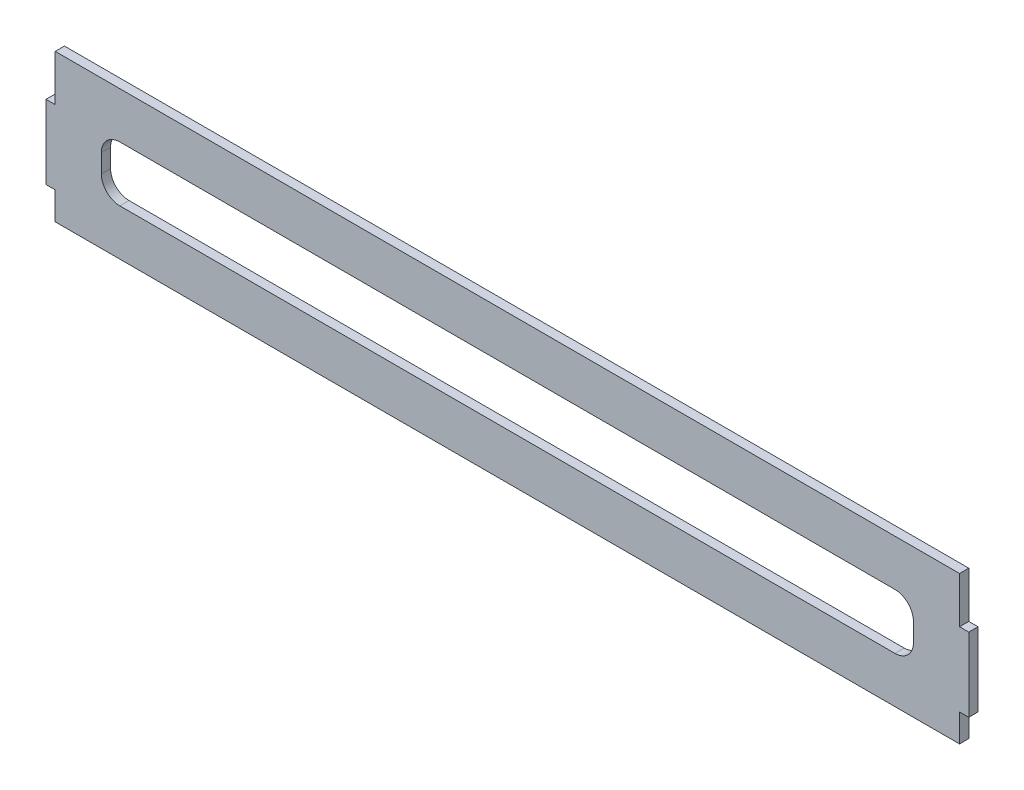
ISO-10303-21;
HEADER;
FILE_DESCRIPTION(('STEP AP214'),'2;1');
FILE_NAME('part.step','',(''),(''),'','','');
FILE_SCHEMA(('AUTOMOTIVE_DESIGN { 1 0 10303 214 1 1 1 1 }'));
ENDSEC;
DATA;
#1=APPLICATION_CONTEXT('core data for automotive mechanical design processes');
#2=APPLICATION_PROTOCOL_DEFINITION('international standard','automotive_design',2000,#1);
#3=PRODUCT_CONTEXT('',#1,'mechanical');
#4=PRODUCT('Part','Part','',(#3));
#5=PRODUCT_RELATED_PRODUCT_CATEGORY('part','',(#4));
#6=PRODUCT_DEFINITION_FORMATION('','',#4);
#7=PRODUCT_DEFINITION_CONTEXT('part definition',#1,'design');
#8=PRODUCT_DEFINITION('design','',#6,#7);
#9=PRODUCT_DEFINITION_SHAPE('','',#8);
#10=(LENGTH_UNIT() NAMED_UNIT(*) SI_UNIT(.MILLI.,.METRE.));
#11=(NAMED_UNIT(*) PLANE_ANGLE_UNIT() SI_UNIT($,.RADIAN.));
#12=(NAMED_UNIT(*) SI_UNIT($,.STERADIAN.) SOLID_ANGLE_UNIT());
#13=UNCERTAINTY_MEASURE_WITH_UNIT(LENGTH_MEASURE(1.E-05),#10,'distance_accuracy_value','');
#14=(GEOMETRIC_REPRESENTATION_CONTEXT(3) GLOBAL_UNCERTAINTY_ASSIGNED_CONTEXT((#13)) GLOBAL_UNIT_ASSIGNED_CONTEXT((#10,
#11,#12)) REPRESENTATION_CONTEXT('',''));
#15=CARTESIAN_POINT('',(0.,0.,0.));
#16=DIRECTION('',(0.,0.,1.));
#17=DIRECTION('',(1.,0.,0.));
#18=AXIS2_PLACEMENT_3D('',#15,#16,#17);
#19=CARTESIAN_POINT('',(490.,0.,5.));
#20=DIRECTION('',(0.,1.,0.));
#21=DIRECTION('',(-1.,0.,0.));
#22=AXIS2_PLACEMENT_3D('',#19,#20,#21);
#23=PLANE('',#22);
#24=DIRECTION('',(1.,0.,0.));
#25=VECTOR('',#24,1.);
#26=CARTESIAN_POINT('',(490.,0.,0.));
#27=LINE('',#26,#25);
#28=CARTESIAN_POINT('',(0.,0.,0.));
#29=VERTEX_POINT('',#28);
#30=CARTESIAN_POINT('',(490.,0.,0.));
#31=VERTEX_POINT('',#30);
#32=EDGE_CURVE('E176',#29,#31,#27,.T.);
#33=ORIENTED_EDGE('',*,*,#32,.T.);
#34=DIRECTION('',(0.,0.,-1.));
#35=VECTOR('',#34,1.);
#36=CARTESIAN_POINT('',(490.,0.,5.));
#37=LINE('',#36,#35);
#38=CARTESIAN_POINT('',(490.,0.,5.));
#39=VERTEX_POINT('',#38);
#40=EDGE_CURVE('E11',#39,#31,#37,.T.);
#41=ORIENTED_EDGE('',*,*,#40,.F.);
#42=DIRECTION('',(1.,0.,0.));
#43=VECTOR('',#42,1.);
#44=CARTESIAN_POINT('',(490.,0.,5.));
#45=LINE('',#44,#43);
#46=CARTESIAN_POINT('',(0.,0.,5.));
#47=VERTEX_POINT('',#46);
#48=EDGE_CURVE('E226',#47,#39,#45,.T.);
#49=ORIENTED_EDGE('',*,*,#48,.F.);
#50=DIRECTION('',(0.,0.,-1.));
#51=VECTOR('',#50,1.);
#52=CARTESIAN_POINT('',(0.,0.,5.));
#53=LINE('',#52,#51);
#54=EDGE_CURVE('E252',#47,#29,#53,.T.);
#55=ORIENTED_EDGE('',*,*,#54,.T.);
#56=EDGE_LOOP('',(#33,#41,#49,#55));
#57=FACE_BOUND('',#56,.T.);
#58=ADVANCED_FACE('F34',(#57),#23,.F.);
#59=CARTESIAN_POINT('',(490.,15.0000000000001,5.));
#60=DIRECTION('',(-1.,0.,0.));
#61=DIRECTION('',(0.,0.,1.));
#62=AXIS2_PLACEMENT_3D('',#59,#60,#61);
#63=PLANE('',#62);
#64=DIRECTION('',(0.,1.,0.));
#65=VECTOR('',#64,1.);
#66=CARTESIAN_POINT('',(490.,15.0000000000001,0.));
#67=LINE('',#66,#65);
#68=CARTESIAN_POINT('',(490.,15.0000000000001,0.));
#69=VERTEX_POINT('',#68);
#70=EDGE_CURVE('E255',#31,#69,#67,.T.);
#71=ORIENTED_EDGE('',*,*,#70,.T.);
#72=DIRECTION('',(0.,0.,-1.));
#73=VECTOR('',#72,1.);
#74=CARTESIAN_POINT('',(490.,15.0000000000001,5.));
#75=LINE('',#74,#73);
#76=CARTESIAN_POINT('',(490.,15.0000000000001,5.));
#77=VERTEX_POINT('',#76);
#78=EDGE_CURVE('E41',#77,#69,#75,.T.);
#79=ORIENTED_EDGE('',*,*,#78,.F.);
#80=DIRECTION('',(0.,1.,0.));
#81=VECTOR('',#80,1.);
#82=CARTESIAN_POINT('',(490.,15.0000000000001,5.));
#83=LINE('',#82,#81);
#84=EDGE_CURVE('E229',#39,#77,#83,.T.);
#85=ORIENTED_EDGE('',*,*,#84,.F.);
#86=ORIENTED_EDGE('',*,*,#40,.T.);
#87=EDGE_LOOP('',(#71,#79,#85,#86));
#88=FACE_BOUND('',#87,.T.);
#89=ADVANCED_FACE('F330',(#88),#63,.F.);
#90=CARTESIAN_POINT('',(495.,15.0000000000001,5.));
#91=DIRECTION('',(0.,1.,0.));
#92=DIRECTION('',(0.,0.,1.));
#93=AXIS2_PLACEMENT_3D('',#90,#91,#92);
#94=PLANE('',#93);
#95=DIRECTION('',(1.,0.,0.));
#96=VECTOR('',#95,1.);
#97=CARTESIAN_POINT('',(495.,15.0000000000001,0.));
#98=LINE('',#97,#96);
#99=CARTESIAN_POINT('',(495.,15.0000000000001,0.));
#100=VERTEX_POINT('',#99);
#101=EDGE_CURVE('E257',#69,#100,#98,.T.);
#102=ORIENTED_EDGE('',*,*,#101,.T.);
#103=DIRECTION('',(0.,0.,-1.));
#104=VECTOR('',#103,1.);
#105=CARTESIAN_POINT('',(495.,15.0000000000001,5.));
#106=LINE('',#105,#104);
#107=CARTESIAN_POINT('',(495.,15.0000000000001,5.));
#108=VERTEX_POINT('',#107);
#109=EDGE_CURVE('E302',#108,#100,#106,.T.);
#110=ORIENTED_EDGE('',*,*,#109,.F.);
#111=DIRECTION('',(1.,0.,0.));
#112=VECTOR('',#111,1.);
#113=CARTESIAN_POINT('',(495.,15.0000000000001,5.));
#114=LINE('',#113,#112);
#115=EDGE_CURVE('E232',#77,#108,#114,.T.);
#116=ORIENTED_EDGE('',*,*,#115,.F.);
#117=ORIENTED_EDGE('',*,*,#78,.T.);
#118=EDGE_LOOP('',(#102,#110,#116,#117));
#119=FACE_BOUND('',#118,.T.);
#120=ADVANCED_FACE('F309',(#119),#94,.F.);
#121=CARTESIAN_POINT('',(495.,55.0000000000001,5.));
#122=DIRECTION('',(-1.,0.,0.));
#123=DIRECTION('',(0.,0.,1.));
#124=AXIS2_PLACEMENT_3D('',#121,#122,#123);
#125=PLANE('',#124);
#126=DIRECTION('',(0.,1.,0.));
#127=VECTOR('',#126,1.);
#128=CARTESIAN_POINT('',(495.,55.0000000000001,0.));
#129=LINE('',#128,#127);
#130=CARTESIAN_POINT('',(495.,55.0000000000001,0.));
#131=VERTEX_POINT('',#130);
#132=EDGE_CURVE('E259',#100,#131,#129,.T.);
#133=ORIENTED_EDGE('',*,*,#132,.T.);
#134=DIRECTION('',(0.,0.,-1.));
#135=VECTOR('',#134,1.);
#136=CARTESIAN_POINT('',(495.,55.0000000000001,5.));
#137=LINE('',#136,#135);
#138=CARTESIAN_POINT('',(495.,55.0000000000001,5.));
#139=VERTEX_POINT('',#138);
#140=EDGE_CURVE('E299',#139,#131,#137,.T.);
#141=ORIENTED_EDGE('',*,*,#140,.F.);
#142=DIRECTION('',(0.,1.,0.));
#143=VECTOR('',#142,1.);
#144=CARTESIAN_POINT('',(495.,55.0000000000001,5.));
#145=LINE('',#144,#143);
#146=EDGE_CURVE('E234',#108,#139,#145,.T.);
#147=ORIENTED_EDGE('',*,*,#146,.F.);
#148=ORIENTED_EDGE('',*,*,#109,.T.);
#149=EDGE_LOOP('',(#133,#141,#147,#148));
#150=FACE_BOUND('',#149,.T.);
#151=ADVANCED_FACE('F318',(#150),#125,.F.);
#152=CARTESIAN_POINT('',(490.,55.0000000000001,5.));
#153=DIRECTION('',(0.,-1.,0.));
#154=DIRECTION('',(0.,0.,-1.));
#155=AXIS2_PLACEMENT_3D('',#152,#153,#154);
#156=PLANE('',#155);
#157=DIRECTION('',(-1.,0.,0.));
#158=VECTOR('',#157,1.);
#159=CARTESIAN_POINT('',(490.,55.0000000000001,0.));
#160=LINE('',#159,#158);
#161=CARTESIAN_POINT('',(490.,55.0000000000001,0.));
#162=VERTEX_POINT('',#161);
#163=EDGE_CURVE('E261',#131,#162,#160,.T.);
#164=ORIENTED_EDGE('',*,*,#163,.T.);
#165=DIRECTION('',(0.,0.,-1.));
#166=VECTOR('',#165,1.);
#167=CARTESIAN_POINT('',(490.,55.0000000000001,5.));
#168=LINE('',#167,#166);
#169=CARTESIAN_POINT('',(490.,55.0000000000001,5.));
#170=VERTEX_POINT('',#169);
#171=EDGE_CURVE('E296',#170,#162,#168,.T.);
#172=ORIENTED_EDGE('',*,*,#171,.F.);
#173=DIRECTION('',(-1.,0.,0.));
#174=VECTOR('',#173,1.);
#175=CARTESIAN_POINT('',(490.,55.0000000000001,5.));
#176=LINE('',#175,#174);
#177=EDGE_CURVE('E236',#139,#170,#176,.T.);
#178=ORIENTED_EDGE('',*,*,#177,.F.);
#179=ORIENTED_EDGE('',*,*,#140,.T.);
#180=EDGE_LOOP('',(#164,#172,#178,#179));
#181=FACE_BOUND('',#180,.T.);
#182=ADVANCED_FACE('F322',(#181),#156,.F.);
#183=CARTESIAN_POINT('',(490.,79.9999999999999,5.));
#184=DIRECTION('',(-1.,0.,0.));
#185=DIRECTION('',(0.,0.,1.));
#186=AXIS2_PLACEMENT_3D('',#183,#184,#185);
#187=PLANE('',#186);
#188=DIRECTION('',(0.,1.,0.));
#189=VECTOR('',#188,1.);
#190=CARTESIAN_POINT('',(490.,79.9999999999999,0.));
#191=LINE('',#190,#189);
#192=CARTESIAN_POINT('',(490.,79.9999999999999,0.));
#193=VERTEX_POINT('',#192);
#194=EDGE_CURVE('E263',#162,#193,#191,.T.);
#195=ORIENTED_EDGE('',*,*,#194,.T.);
#196=DIRECTION('',(0.,0.,-1.));
#197=VECTOR('',#196,1.);
#198=CARTESIAN_POINT('',(490.,79.9999999999999,5.));
#199=LINE('',#198,#197);
#200=CARTESIAN_POINT('',(490.,79.9999999999999,5.));
#201=VERTEX_POINT('',#200);
#202=EDGE_CURVE('E293',#201,#193,#199,.T.);
#203=ORIENTED_EDGE('',*,*,#202,.F.);
#204=DIRECTION('',(0.,1.,0.));
#205=VECTOR('',#204,1.);
#206=CARTESIAN_POINT('',(490.,79.9999999999999,5.));
#207=LINE('',#206,#205);
#208=EDGE_CURVE('E238',#170,#201,#207,.T.);
#209=ORIENTED_EDGE('',*,*,#208,.F.);
#210=ORIENTED_EDGE('',*,*,#171,.T.);
#211=EDGE_LOOP('',(#195,#203,#209,#210));
#212=FACE_BOUND('',#211,.T.);
#213=ADVANCED_FACE('F363',(#212),#187,.F.);
#214=CARTESIAN_POINT('',(0.,79.9999999999999,5.));
#215=DIRECTION('',(0.,-1.,0.));
#216=DIRECTION('',(0.,0.,-1.));
#217=AXIS2_PLACEMENT_3D('',#214,#215,#216);
#218=PLANE('',#217);
#219=DIRECTION('',(-1.,0.,0.));
#220=VECTOR('',#219,1.);
#221=CARTESIAN_POINT('',(0.,79.9999999999999,0.));
#222=LINE('',#221,#220);
#223=CARTESIAN_POINT('',(0.,79.9999999999999,0.));
#224=VERTEX_POINT('',#223);
#225=EDGE_CURVE('E265',#193,#224,#222,.T.);
#226=ORIENTED_EDGE('',*,*,#225,.T.);
#227=DIRECTION('',(0.,0.,-1.));
#228=VECTOR('',#227,1.);
#229=CARTESIAN_POINT('',(0.,79.9999999999999,5.));
#230=LINE('',#229,#228);
#231=CARTESIAN_POINT('',(0.,79.9999999999999,5.));
#232=VERTEX_POINT('',#231);
#233=EDGE_CURVE('E290',#232,#224,#230,.T.);
#234=ORIENTED_EDGE('',*,*,#233,.F.);
#235=DIRECTION('',(-1.,0.,0.));
#236=VECTOR('',#235,1.);
#237=CARTESIAN_POINT('',(0.,79.9999999999999,5.));
#238=LINE('',#237,#236);
#239=EDGE_CURVE('E240',#201,#232,#238,.T.);
#240=ORIENTED_EDGE('',*,*,#239,.F.);
#241=ORIENTED_EDGE('',*,*,#202,.T.);
#242=EDGE_LOOP('',(#226,#234,#240,#241));
#243=FACE_BOUND('',#242,.T.);
#244=ADVANCED_FACE('F361',(#243),#218,.F.);
#245=CARTESIAN_POINT('',(0.,55.0000000000001,5.));
#246=DIRECTION('',(1.,0.,0.));
#247=DIRECTION('',(0.,0.,-1.));
#248=AXIS2_PLACEMENT_3D('',#245,#246,#247);
#249=PLANE('',#248);
#250=DIRECTION('',(0.,-1.,0.));
#251=VECTOR('',#250,1.);
#252=CARTESIAN_POINT('',(0.,55.0000000000001,0.));
#253=LINE('',#252,#251);
#254=CARTESIAN_POINT('',(0.,55.0000000000001,0.));
#255=VERTEX_POINT('',#254);
#256=EDGE_CURVE('E267',#224,#255,#253,.T.);
#257=ORIENTED_EDGE('',*,*,#256,.T.);
#258=DIRECTION('',(0.,0.,-1.));
#259=VECTOR('',#258,1.);
#260=CARTESIAN_POINT('',(0.,55.0000000000001,5.));
#261=LINE('',#260,#259);
#262=CARTESIAN_POINT('',(0.,55.0000000000001,5.));
#263=VERTEX_POINT('',#262);
#264=EDGE_CURVE('E287',#263,#255,#261,.T.);
#265=ORIENTED_EDGE('',*,*,#264,.F.);
#266=DIRECTION('',(0.,-1.,0.));
#267=VECTOR('',#266,1.);
#268=CARTESIAN_POINT('',(0.,55.0000000000001,5.));
#269=LINE('',#268,#267);
#270=EDGE_CURVE('E242',#232,#263,#269,.T.);
#271=ORIENTED_EDGE('',*,*,#270,.F.);
#272=ORIENTED_EDGE('',*,*,#233,.T.);
#273=EDGE_LOOP('',(#257,#265,#271,#272));
#274=FACE_BOUND('',#273,.T.);
#275=ADVANCED_FACE('F357',(#274),#249,.F.);
#276=CARTESIAN_POINT('',(-5.,55.0000000000001,5.));
#277=DIRECTION('',(0.,-1.,0.));
#278=DIRECTION('',(0.,0.,-1.));
#279=AXIS2_PLACEMENT_3D('',#276,#277,#278);
#280=PLANE('',#279);
#281=DIRECTION('',(-1.,0.,0.));
#282=VECTOR('',#281,1.);
#283=CARTESIAN_POINT('',(-5.,55.0000000000001,0.));
#284=LINE('',#283,#282);
#285=CARTESIAN_POINT('',(-5.,55.0000000000001,0.));
#286=VERTEX_POINT('',#285);
#287=EDGE_CURVE('E269',#255,#286,#284,.T.);
#288=ORIENTED_EDGE('',*,*,#287,.T.);
#289=DIRECTION('',(0.,0.,-1.));
#290=VECTOR('',#289,1.);
#291=CARTESIAN_POINT('',(-5.,55.0000000000001,5.));
#292=LINE('',#291,#290);
#293=CARTESIAN_POINT('',(-5.,55.0000000000001,5.));
#294=VERTEX_POINT('',#293);
#295=EDGE_CURVE('E284',#294,#286,#292,.T.);
#296=ORIENTED_EDGE('',*,*,#295,.F.);
#297=DIRECTION('',(-1.,0.,0.));
#298=VECTOR('',#297,1.);
#299=CARTESIAN_POINT('',(-5.,55.0000000000001,5.));
#300=LINE('',#299,#298);
#301=EDGE_CURVE('E244',#263,#294,#300,.T.);
#302=ORIENTED_EDGE('',*,*,#301,.F.);
#303=ORIENTED_EDGE('',*,*,#264,.T.);
#304=EDGE_LOOP('',(#288,#296,#302,#303));
#305=FACE_BOUND('',#304,.T.);
#306=ADVANCED_FACE('F352',(#305),#280,.F.);
#307=CARTESIAN_POINT('',(-5.,15.,5.));
#308=DIRECTION('',(1.,0.,0.));
#309=DIRECTION('',(0.,0.,-1.));
#310=AXIS2_PLACEMENT_3D('',#307,#308,#309);
#311=PLANE('',#310);
#312=DIRECTION('',(0.,-1.,0.));
#313=VECTOR('',#312,1.);
#314=CARTESIAN_POINT('',(-5.,15.,0.));
#315=LINE('',#314,#313);
#316=CARTESIAN_POINT('',(-5.,15.,0.));
#317=VERTEX_POINT('',#316);
#318=EDGE_CURVE('E271',#286,#317,#315,.T.);
#319=ORIENTED_EDGE('',*,*,#318,.T.);
#320=DIRECTION('',(0.,0.,-1.));
#321=VECTOR('',#320,1.);
#322=CARTESIAN_POINT('',(-5.,15.,5.));
#323=LINE('',#322,#321);
#324=CARTESIAN_POINT('',(-5.,15.,5.));
#325=VERTEX_POINT('',#324);
#326=EDGE_CURVE('E281',#325,#317,#323,.T.);
#327=ORIENTED_EDGE('',*,*,#326,.F.);
#328=DIRECTION('',(0.,-1.,0.));
#329=VECTOR('',#328,1.);
#330=CARTESIAN_POINT('',(-5.,15.,5.));
#331=LINE('',#330,#329);
#332=EDGE_CURVE('E246',#294,#325,#331,.T.);
#333=ORIENTED_EDGE('',*,*,#332,.F.);
#334=ORIENTED_EDGE('',*,*,#295,.T.);
#335=EDGE_LOOP('',(#319,#327,#333,#334));
#336=FACE_BOUND('',#335,.T.);
#337=ADVANCED_FACE('F346',(#336),#311,.F.);
#338=CARTESIAN_POINT('',(0.,15.,5.));
#339=DIRECTION('',(0.,1.,0.));
#340=DIRECTION('',(0.,0.,1.));
#341=AXIS2_PLACEMENT_3D('',#338,#339,#340);
#342=PLANE('',#341);
#343=DIRECTION('',(1.,0.,0.));
#344=VECTOR('',#343,1.);
#345=CARTESIAN_POINT('',(0.,15.,0.));
#346=LINE('',#345,#344);
#347=CARTESIAN_POINT('',(0.,15.,0.));
#348=VERTEX_POINT('',#347);
#349=EDGE_CURVE('E273',#317,#348,#346,.T.);
#350=ORIENTED_EDGE('',*,*,#349,.T.);
#351=DIRECTION('',(0.,0.,-1.));
#352=VECTOR('',#351,1.);
#353=CARTESIAN_POINT('',(0.,15.,5.));
#354=LINE('',#353,#352);
#355=CARTESIAN_POINT('',(0.,15.,5.));
#356=VERTEX_POINT('',#355);
#357=EDGE_CURVE('E278',#356,#348,#354,.T.);
#358=ORIENTED_EDGE('',*,*,#357,.F.);
#359=DIRECTION('',(1.,0.,0.));
#360=VECTOR('',#359,1.);
#361=CARTESIAN_POINT('',(0.,15.,5.));
#362=LINE('',#361,#360);
#363=EDGE_CURVE('E248',#325,#356,#362,.T.);
#364=ORIENTED_EDGE('',*,*,#363,.F.);
#365=ORIENTED_EDGE('',*,*,#326,.T.);
#366=EDGE_LOOP('',(#350,#358,#364,#365));
#367=FACE_BOUND('',#366,.T.);
#368=ADVANCED_FACE('F342',(#367),#342,.F.);
#369=CARTESIAN_POINT('',(0.,0.,5.));
#370=DIRECTION('',(1.,0.,0.));
#371=DIRECTION('',(0.,0.,-1.));
#372=AXIS2_PLACEMENT_3D('',#369,#370,#371);
#373=PLANE('',#372);
#374=DIRECTION('',(0.,-1.,0.));
#375=VECTOR('',#374,1.);
#376=CARTESIAN_POINT('',(0.,0.,0.));
#377=LINE('',#376,#375);
#378=EDGE_CURVE('E230',#348,#29,#377,.T.);
#379=ORIENTED_EDGE('',*,*,#378,.T.);
#380=ORIENTED_EDGE('',*,*,#54,.F.);
#381=DIRECTION('',(0.,-1.,0.));
#382=VECTOR('',#381,1.);
#383=CARTESIAN_POINT('',(0.,0.,5.));
#384=LINE('',#383,#382);
#385=EDGE_CURVE('E250',#356,#47,#384,.T.);
#386=ORIENTED_EDGE('',*,*,#385,.F.);
#387=ORIENTED_EDGE('',*,*,#357,.T.);
#388=EDGE_LOOP('',(#379,#380,#386,#387));
#389=FACE_BOUND('',#388,.T.);
#390=ADVANCED_FACE('F337',(#389),#373,.F.);
#391=CARTESIAN_POINT('',(0.,0.,5.));
#392=DIRECTION('',(0.,0.,-1.));
#393=DIRECTION('',(-1.,0.,0.));
#394=AXIS2_PLACEMENT_3D('',#391,#392,#393);
#395=PLANE('',#394);
#396=DIRECTION('',(0.,1.,0.));
#397=VECTOR('',#396,1.);
#398=CARTESIAN_POINT('',(465.,35.,5.));
#399=LINE('',#398,#397);
#400=CARTESIAN_POINT('',(465.,35.,5.));
#401=VERTEX_POINT('',#400);
#402=CARTESIAN_POINT('',(465.,45.,5.));
#403=VERTEX_POINT('',#402);
#404=EDGE_CURVE('E190',#401,#403,#399,.T.);
#405=ORIENTED_EDGE('',*,*,#404,.F.);
#406=CARTESIAN_POINT('',(455.,35.,5.));
#407=DIRECTION('',(0.,0.,1.));
#408=DIRECTION('',(-1.,0.,0.));
#409=AXIS2_PLACEMENT_3D('',#406,#407,#408);
#410=CIRCLE('',#409,10.);
#411=CARTESIAN_POINT('',(455.,25.,5.));
#412=VERTEX_POINT('',#411);
#413=EDGE_CURVE('E48',#412,#401,#410,.T.);
#414=ORIENTED_EDGE('',*,*,#413,.F.);
#415=DIRECTION('',(1.,0.,0.));
#416=VECTOR('',#415,1.);
#417=CARTESIAN_POINT('',(35.,25.,5.));
#418=LINE('',#417,#416);
#419=CARTESIAN_POINT('',(35.,25.,5.));
#420=VERTEX_POINT('',#419);
#421=EDGE_CURVE('E182',#420,#412,#418,.T.);
#422=ORIENTED_EDGE('',*,*,#421,.F.);
#423=CARTESIAN_POINT('',(35.,35.,5.));
#424=DIRECTION('',(0.,0.,1.));
#425=DIRECTION('',(-1.,0.,0.));
#426=AXIS2_PLACEMENT_3D('',#423,#424,#425);
#427=CIRCLE('',#426,10.);
#428=CARTESIAN_POINT('',(25.,35.,5.));
#429=VERTEX_POINT('',#428);
#430=EDGE_CURVE('E209',#429,#420,#427,.T.);
#431=ORIENTED_EDGE('',*,*,#430,.F.);
#432=DIRECTION('',(0.,-1.,0.));
#433=VECTOR('',#432,1.);
#434=CARTESIAN_POINT('',(25.,35.,5.));
#435=LINE('',#434,#433);
#436=CARTESIAN_POINT('',(25.,45.,5.));
#437=VERTEX_POINT('',#436);
#438=EDGE_CURVE('E206',#437,#429,#435,.T.);
#439=ORIENTED_EDGE('',*,*,#438,.F.);
#440=CARTESIAN_POINT('',(35.,45.,5.));
#441=DIRECTION('',(0.,0.,1.));
#442=DIRECTION('',(1.,0.,0.));
#443=AXIS2_PLACEMENT_3D('',#440,#441,#442);
#444=CIRCLE('',#443,10.);
#445=CARTESIAN_POINT('',(35.,55.,5.));
#446=VERTEX_POINT('',#445);
#447=EDGE_CURVE('E203',#446,#437,#444,.T.);
#448=ORIENTED_EDGE('',*,*,#447,.F.);
#449=DIRECTION('',(-1.,0.,0.));
#450=VECTOR('',#449,1.);
#451=CARTESIAN_POINT('',(35.,55.,5.));
#452=LINE('',#451,#450);
#453=CARTESIAN_POINT('',(455.,55.,5.));
#454=VERTEX_POINT('',#453);
#455=EDGE_CURVE('E200',#454,#446,#452,.T.);
#456=ORIENTED_EDGE('',*,*,#455,.F.);
#457=CARTESIAN_POINT('',(455.,45.,5.));
#458=DIRECTION('',(0.,0.,1.));
#459=DIRECTION('',(1.,0.,0.));
#460=AXIS2_PLACEMENT_3D('',#457,#458,#459);
#461=CIRCLE('',#460,10.);
#462=EDGE_CURVE('E197',#403,#454,#461,.T.);
#463=ORIENTED_EDGE('',*,*,#462,.F.);
#464=EDGE_LOOP('',(#405,#414,#422,#431,#439,#448,#456,#463));
#465=FACE_BOUND('',#464,.T.);
#466=ORIENTED_EDGE('',*,*,#48,.T.);
#467=ORIENTED_EDGE('',*,*,#84,.T.);
#468=ORIENTED_EDGE('',*,*,#115,.T.);
#469=ORIENTED_EDGE('',*,*,#146,.T.);
#470=ORIENTED_EDGE('',*,*,#177,.T.);
#471=ORIENTED_EDGE('',*,*,#208,.T.);
#472=ORIENTED_EDGE('',*,*,#239,.T.);
#473=ORIENTED_EDGE('',*,*,#270,.T.);
#474=ORIENTED_EDGE('',*,*,#301,.T.);
#475=ORIENTED_EDGE('',*,*,#332,.T.);
#476=ORIENTED_EDGE('',*,*,#363,.T.);
#477=ORIENTED_EDGE('',*,*,#385,.T.);
#478=EDGE_LOOP('',(#466,#467,#468,#469,#470,#471,#472,#473,#474,#475,#476,#477));
#479=FACE_BOUND('',#478,.T.);
#480=ADVANCED_FACE('F326',(#465,#479),#395,.F.);
#481=CARTESIAN_POINT('',(0.,0.,0.));
#482=DIRECTION('',(0.,0.,-1.));
#483=DIRECTION('',(-1.,0.,0.));
#484=AXIS2_PLACEMENT_3D('',#481,#482,#483);
#485=PLANE('',#484);
#486=CARTESIAN_POINT('',(455.,35.,0.));
#487=DIRECTION('',(0.,0.,-1.));
#488=DIRECTION('',(-1.,0.,0.));
#489=AXIS2_PLACEMENT_3D('',#486,#487,#488);
#490=CIRCLE('',#489,10.);
#491=CARTESIAN_POINT('',(455.,25.,0.));
#492=VERTEX_POINT('',#491);
#493=CARTESIAN_POINT('',(465.,35.,0.));
#494=VERTEX_POINT('',#493);
#495=EDGE_CURVE('E180',#492,#494,#490,.F.);
#496=ORIENTED_EDGE('',*,*,#495,.T.);
#497=DIRECTION('',(0.,1.,0.));
#498=VECTOR('',#497,1.);
#499=CARTESIAN_POINT('',(465.,35.,0.));
#500=LINE('',#499,#498);
#501=CARTESIAN_POINT('',(465.,45.,0.));
#502=VERTEX_POINT('',#501);
#503=EDGE_CURVE('E169',#494,#502,#500,.T.);
#504=ORIENTED_EDGE('',*,*,#503,.T.);
#505=CARTESIAN_POINT('',(455.,45.,0.));
#506=DIRECTION('',(0.,0.,-1.));
#507=DIRECTION('',(-1.,0.,0.));
#508=AXIS2_PLACEMENT_3D('',#505,#506,#507);
#509=CIRCLE('',#508,10.);
#510=CARTESIAN_POINT('',(455.,55.,0.));
#511=VERTEX_POINT('',#510);
#512=EDGE_CURVE('E540',#502,#511,#509,.F.);
#513=ORIENTED_EDGE('',*,*,#512,.T.);
#514=DIRECTION('',(-1.,0.,0.));
#515=VECTOR('',#514,1.);
#516=CARTESIAN_POINT('',(35.,55.,0.));
#517=LINE('',#516,#515);
#518=CARTESIAN_POINT('',(35.,55.,0.));
#519=VERTEX_POINT('',#518);
#520=EDGE_CURVE('E545',#511,#519,#517,.T.);
#521=ORIENTED_EDGE('',*,*,#520,.T.);
#522=CARTESIAN_POINT('',(35.,45.,0.));
#523=DIRECTION('',(0.,0.,-1.));
#524=DIRECTION('',(-1.,0.,0.));
#525=AXIS2_PLACEMENT_3D('',#522,#523,#524);
#526=CIRCLE('',#525,10.);
#527=CARTESIAN_POINT('',(25.,45.,0.));
#528=VERTEX_POINT('',#527);
#529=EDGE_CURVE('E548',#519,#528,#526,.F.);
#530=ORIENTED_EDGE('',*,*,#529,.T.);
#531=DIRECTION('',(0.,-1.,0.));
#532=VECTOR('',#531,1.);
#533=CARTESIAN_POINT('',(25.,35.,0.));
#534=LINE('',#533,#532);
#535=CARTESIAN_POINT('',(25.,35.,0.));
#536=VERTEX_POINT('',#535);
#537=EDGE_CURVE('E552',#528,#536,#534,.T.);
#538=ORIENTED_EDGE('',*,*,#537,.T.);
#539=CARTESIAN_POINT('',(35.,35.,0.));
#540=DIRECTION('',(0.,0.,-1.));
#541=DIRECTION('',(-1.,0.,0.));
#542=AXIS2_PLACEMENT_3D('',#539,#540,#541);
#543=CIRCLE('',#542,10.);
#544=CARTESIAN_POINT('',(35.,25.,0.));
#545=VERTEX_POINT('',#544);
#546=EDGE_CURVE('E192',#536,#545,#543,.F.);
#547=ORIENTED_EDGE('',*,*,#546,.T.);
#548=DIRECTION('',(1.,0.,0.));
#549=VECTOR('',#548,1.);
#550=CARTESIAN_POINT('',(35.,25.,0.));
#551=LINE('',#550,#549);
#552=EDGE_CURVE('E188',#545,#492,#551,.T.);
#553=ORIENTED_EDGE('',*,*,#552,.T.);
#554=EDGE_LOOP('',(#496,#504,#513,#521,#530,#538,#547,#553));
#555=FACE_BOUND('',#554,.T.);
#556=ORIENTED_EDGE('',*,*,#32,.F.);
#557=ORIENTED_EDGE('',*,*,#378,.F.);
#558=ORIENTED_EDGE('',*,*,#349,.F.);
#559=ORIENTED_EDGE('',*,*,#318,.F.);
#560=ORIENTED_EDGE('',*,*,#287,.F.);
#561=ORIENTED_EDGE('',*,*,#256,.F.);
#562=ORIENTED_EDGE('',*,*,#225,.F.);
#563=ORIENTED_EDGE('',*,*,#194,.F.);
#564=ORIENTED_EDGE('',*,*,#163,.F.);
#565=ORIENTED_EDGE('',*,*,#132,.F.);
#566=ORIENTED_EDGE('',*,*,#101,.F.);
#567=ORIENTED_EDGE('',*,*,#70,.F.);
#568=EDGE_LOOP('',(#556,#557,#558,#559,#560,#561,#562,#563,#564,#565,#566,#567));
#569=FACE_BOUND('',#568,.T.);
#570=ADVANCED_FACE('F185',(#555,#569),#485,.T.);
#571=CARTESIAN_POINT('',(455.,35.,-0.00100000000000013));
#572=DIRECTION('',(0.,0.,1.));
#573=DIRECTION('',(1.,0.,0.));
#574=AXIS2_PLACEMENT_3D('',#571,#572,#573);
#575=CYLINDRICAL_SURFACE('',#574,10.);
#576=DIRECTION('',(0.,0.,1.));
#577=VECTOR('',#576,1.);
#578=CARTESIAN_POINT('',(455.,25.,-0.00100000000000013));
#579=LINE('',#578,#577);
#580=EDGE_CURVE('E177',#492,#412,#579,.T.);
#581=ORIENTED_EDGE('',*,*,#580,.T.);
#582=ORIENTED_EDGE('',*,*,#413,.T.);
#583=DIRECTION('',(0.,0.,1.));
#584=VECTOR('',#583,1.);
#585=CARTESIAN_POINT('',(465.,35.,-0.00100000000000013));
#586=LINE('',#585,#584);
#587=EDGE_CURVE('E171',#494,#401,#586,.T.);
#588=ORIENTED_EDGE('',*,*,#587,.F.);
#589=ORIENTED_EDGE('',*,*,#495,.F.);
#590=EDGE_LOOP('',(#581,#582,#588,#589));
#591=FACE_BOUND('',#590,.T.);
#592=ADVANCED_FACE('F179',(#591),#575,.F.);
#593=CARTESIAN_POINT('',(35.,25.,-0.00100000000000013));
#594=DIRECTION('',(0.,-1.,0.));
#595=DIRECTION('',(0.,0.,-1.));
#596=AXIS2_PLACEMENT_3D('',#593,#594,#595);
#597=PLANE('',#596);
#598=DIRECTION('',(0.,0.,1.));
#599=VECTOR('',#598,1.);
#600=CARTESIAN_POINT('',(35.,25.,-0.00100000000000013));
#601=LINE('',#600,#599);
#602=EDGE_CURVE('E215',#545,#420,#601,.T.);
#603=ORIENTED_EDGE('',*,*,#602,.T.);
#604=ORIENTED_EDGE('',*,*,#421,.T.);
#605=ORIENTED_EDGE('',*,*,#580,.F.);
#606=ORIENTED_EDGE('',*,*,#552,.F.);
#607=EDGE_LOOP('',(#603,#604,#605,#606));
#608=FACE_BOUND('',#607,.T.);
#609=ADVANCED_FACE('F466',(#608),#597,.F.);
#610=CARTESIAN_POINT('',(35.,35.,-0.00100000000000013));
#611=DIRECTION('',(0.,0.,1.));
#612=DIRECTION('',(1.,0.,0.));
#613=AXIS2_PLACEMENT_3D('',#610,#611,#612);
#614=CYLINDRICAL_SURFACE('',#613,10.);
#615=DIRECTION('',(0.,0.,1.));
#616=VECTOR('',#615,1.);
#617=CARTESIAN_POINT('',(25.,35.,-0.00100000000000013));
#618=LINE('',#617,#616);
#619=EDGE_CURVE('E217',#536,#429,#618,.T.);
#620=ORIENTED_EDGE('',*,*,#619,.T.);
#621=ORIENTED_EDGE('',*,*,#430,.T.);
#622=ORIENTED_EDGE('',*,*,#602,.F.);
#623=ORIENTED_EDGE('',*,*,#546,.F.);
#624=EDGE_LOOP('',(#620,#621,#622,#623));
#625=FACE_BOUND('',#624,.T.);
#626=ADVANCED_FACE('F475',(#625),#614,.F.);
#627=CARTESIAN_POINT('',(25.,35.,-0.00100000000000013));
#628=DIRECTION('',(-1.,0.,0.));
#629=DIRECTION('',(0.,0.,1.));
#630=AXIS2_PLACEMENT_3D('',#627,#628,#629);
#631=PLANE('',#630);
#632=DIRECTION('',(0.,0.,1.));
#633=VECTOR('',#632,1.);
#634=CARTESIAN_POINT('',(25.,45.,-0.00100000000000013));
#635=LINE('',#634,#633);
#636=EDGE_CURVE('E219',#528,#437,#635,.T.);
#637=ORIENTED_EDGE('',*,*,#636,.T.);
#638=ORIENTED_EDGE('',*,*,#438,.T.);
#639=ORIENTED_EDGE('',*,*,#619,.F.);
#640=ORIENTED_EDGE('',*,*,#537,.F.);
#641=EDGE_LOOP('',(#637,#638,#639,#640));
#642=FACE_BOUND('',#641,.T.);
#643=ADVANCED_FACE('F485',(#642),#631,.F.);
#644=CARTESIAN_POINT('',(35.,45.,-0.00100000000000013));
#645=DIRECTION('',(0.,0.,1.));
#646=DIRECTION('',(1.,0.,0.));
#647=AXIS2_PLACEMENT_3D('',#644,#645,#646);
#648=CYLINDRICAL_SURFACE('',#647,10.);
#649=DIRECTION('',(0.,0.,1.));
#650=VECTOR('',#649,1.);
#651=CARTESIAN_POINT('',(35.,55.,-0.00100000000000013));
#652=LINE('',#651,#650);
#653=EDGE_CURVE('E221',#519,#446,#652,.T.);
#654=ORIENTED_EDGE('',*,*,#653,.T.);
#655=ORIENTED_EDGE('',*,*,#447,.T.);
#656=ORIENTED_EDGE('',*,*,#636,.F.);
#657=ORIENTED_EDGE('',*,*,#529,.F.);
#658=EDGE_LOOP('',(#654,#655,#656,#657));
#659=FACE_BOUND('',#658,.T.);
#660=ADVANCED_FACE('F495',(#659),#648,.F.);
#661=CARTESIAN_POINT('',(35.,55.,-0.00100000000000013));
#662=DIRECTION('',(0.,1.,0.));
#663=DIRECTION('',(0.,0.,1.));
#664=AXIS2_PLACEMENT_3D('',#661,#662,#663);
#665=PLANE('',#664);
#666=DIRECTION('',(0.,0.,1.));
#667=VECTOR('',#666,1.);
#668=CARTESIAN_POINT('',(455.,55.,-0.00100000000000013));
#669=LINE('',#668,#667);
#670=EDGE_CURVE('E223',#511,#454,#669,.T.);
#671=ORIENTED_EDGE('',*,*,#670,.T.);
#672=ORIENTED_EDGE('',*,*,#455,.T.);
#673=ORIENTED_EDGE('',*,*,#653,.F.);
#674=ORIENTED_EDGE('',*,*,#520,.F.);
#675=EDGE_LOOP('',(#671,#672,#673,#674));
#676=FACE_BOUND('',#675,.T.);
#677=ADVANCED_FACE('F505',(#676),#665,.F.);
#678=CARTESIAN_POINT('',(455.,45.,-0.00100000000000013));
#679=DIRECTION('',(0.,0.,1.));
#680=DIRECTION('',(1.,0.,0.));
#681=AXIS2_PLACEMENT_3D('',#678,#679,#680);
#682=CYLINDRICAL_SURFACE('',#681,10.);
#683=DIRECTION('',(0.,0.,1.));
#684=VECTOR('',#683,1.);
#685=CARTESIAN_POINT('',(465.,45.,-0.00100000000000013));
#686=LINE('',#685,#684);
#687=EDGE_CURVE('E56',#502,#403,#686,.T.);
#688=ORIENTED_EDGE('',*,*,#687,.T.);
#689=ORIENTED_EDGE('',*,*,#462,.T.);
#690=ORIENTED_EDGE('',*,*,#670,.F.);
#691=ORIENTED_EDGE('',*,*,#512,.F.);
#692=EDGE_LOOP('',(#688,#689,#690,#691));
#693=FACE_BOUND('',#692,.T.);
#694=ADVANCED_FACE('F515',(#693),#682,.F.);
#695=CARTESIAN_POINT('',(465.,35.,-0.00100000000000013));
#696=DIRECTION('',(1.,0.,0.));
#697=DIRECTION('',(0.,0.,-1.));
#698=AXIS2_PLACEMENT_3D('',#695,#696,#697);
#699=PLANE('',#698);
#700=ORIENTED_EDGE('',*,*,#587,.T.);
#701=ORIENTED_EDGE('',*,*,#404,.T.);
#702=ORIENTED_EDGE('',*,*,#687,.F.);
#703=ORIENTED_EDGE('',*,*,#503,.F.);
#704=EDGE_LOOP('',(#700,#701,#702,#703));
#705=FACE_BOUND('',#704,.T.);
#706=ADVANCED_FACE('F170',(#705),#699,.F.);
#707=CLOSED_SHELL('',(#58,#89,#120,#151,#182,#213,#244,#275,#306,#337,#368,#390,#480,#570,#592,
#609,#626,#643,#660,#677,#694,#706));
#708=MANIFOLD_SOLID_BREP('B2',#707);
#709=ADVANCED_BREP_SHAPE_REPRESENTATION('',(#18,#708),#14);
#710=SHAPE_DEFINITION_REPRESENTATION(#9,#709);
ENDSEC;
END-ISO-10303-21;
